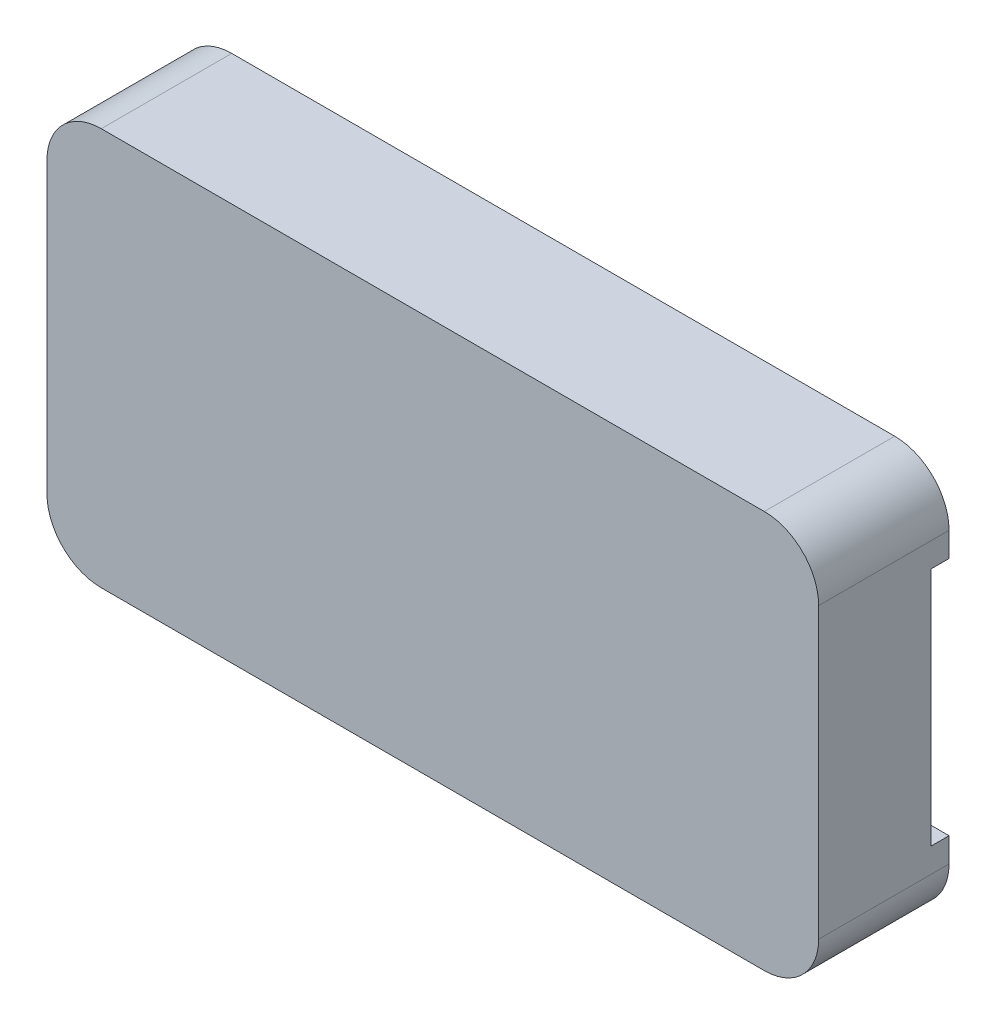
ISO-10303-21;
HEADER;
FILE_DESCRIPTION(('STEP AP214'),'2;1');
FILE_NAME('part.step','',(''),(''),'','','');
FILE_SCHEMA(('AUTOMOTIVE_DESIGN { 1 0 10303 214 1 1 1 1 }'));
ENDSEC;
DATA;
#1=APPLICATION_CONTEXT('core data for automotive mechanical design processes');
#2=APPLICATION_PROTOCOL_DEFINITION('international standard','automotive_design',2000,#1);
#3=PRODUCT_CONTEXT('',#1,'mechanical');
#4=PRODUCT('Part','Part','',(#3));
#5=PRODUCT_RELATED_PRODUCT_CATEGORY('part','',(#4));
#6=PRODUCT_DEFINITION_FORMATION('','',#4);
#7=PRODUCT_DEFINITION_CONTEXT('part definition',#1,'design');
#8=PRODUCT_DEFINITION('design','',#6,#7);
#9=PRODUCT_DEFINITION_SHAPE('','',#8);
#10=(LENGTH_UNIT() NAMED_UNIT(*) SI_UNIT(.MILLI.,.METRE.));
#11=(NAMED_UNIT(*) PLANE_ANGLE_UNIT() SI_UNIT($,.RADIAN.));
#12=(NAMED_UNIT(*) SI_UNIT($,.STERADIAN.) SOLID_ANGLE_UNIT());
#13=UNCERTAINTY_MEASURE_WITH_UNIT(LENGTH_MEASURE(1.E-05),#10,'distance_accuracy_value','');
#14=(GEOMETRIC_REPRESENTATION_CONTEXT(3) GLOBAL_UNCERTAINTY_ASSIGNED_CONTEXT((#13)) GLOBAL_UNIT_ASSIGNED_CONTEXT((#10,
#11,#12)) REPRESENTATION_CONTEXT('',''));
#15=CARTESIAN_POINT('',(0.,0.,0.));
#16=DIRECTION('',(0.,0.,1.));
#17=DIRECTION('',(1.,0.,0.));
#18=AXIS2_PLACEMENT_3D('',#15,#16,#17);
#19=CARTESIAN_POINT('',(0.,0.,5.2));
#20=DIRECTION('',(0.,0.,1.));
#21=DIRECTION('',(1.,0.,0.));
#22=AXIS2_PLACEMENT_3D('',#19,#20,#21);
#23=PLANE('',#22);
#24=DIRECTION('',(0.,1.,0.));
#25=VECTOR('',#24,1.);
#26=CARTESIAN_POINT('',(19.9,6.625,5.2));
#27=LINE('',#26,#25);
#28=CARTESIAN_POINT('',(19.9,4.925,5.2));
#29=VERTEX_POINT('',#28);
#30=CARTESIAN_POINT('',(19.9,6.625,5.2));
#31=VERTEX_POINT('',#30);
#32=EDGE_CURVE('E259',#29,#31,#27,.T.);
#33=ORIENTED_EDGE('',*,*,#32,.F.);
#34=DIRECTION('',(1.,0.,0.));
#35=VECTOR('',#34,1.);
#36=CARTESIAN_POINT('',(18.4,4.925,5.2));
#37=LINE('',#36,#35);
#38=CARTESIAN_POINT('',(18.4,4.925,5.2));
#39=VERTEX_POINT('',#38);
#40=EDGE_CURVE('E274',#39,#29,#37,.T.);
#41=ORIENTED_EDGE('',*,*,#40,.F.);
#42=DIRECTION('',(0.,1.,0.));
#43=VECTOR('',#42,1.);
#44=CARTESIAN_POINT('',(18.4,3.815,5.2));
#45=LINE('',#44,#43);
#46=CARTESIAN_POINT('',(18.4,3.815,5.2));
#47=VERTEX_POINT('',#46);
#48=EDGE_CURVE('E279',#47,#39,#45,.T.);
#49=ORIENTED_EDGE('',*,*,#48,.F.);
#50=DIRECTION('',(-1.,0.,0.));
#51=VECTOR('',#50,1.);
#52=CARTESIAN_POINT('',(19.11,3.815,5.2));
#53=LINE('',#52,#51);
#54=CARTESIAN_POINT('',(19.11,3.815,5.2));
#55=VERTEX_POINT('',#54);
#56=EDGE_CURVE('E326',#55,#47,#53,.T.);
#57=ORIENTED_EDGE('',*,*,#56,.F.);
#58=DIRECTION('',(0.,1.,0.));
#59=VECTOR('',#58,1.);
#60=CARTESIAN_POINT('',(19.11,0.555,5.2));
#61=LINE('',#60,#59);
#62=CARTESIAN_POINT('',(19.11,0.555,5.2));
#63=VERTEX_POINT('',#62);
#64=EDGE_CURVE('E323',#63,#55,#61,.T.);
#65=ORIENTED_EDGE('',*,*,#64,.F.);
#66=DIRECTION('',(1.,0.,0.));
#67=VECTOR('',#66,1.);
#68=CARTESIAN_POINT('',(18.4,0.555,5.2));
#69=LINE('',#68,#67);
#70=CARTESIAN_POINT('',(18.4,0.555,5.2));
#71=VERTEX_POINT('',#70);
#72=EDGE_CURVE('E320',#71,#63,#69,.T.);
#73=ORIENTED_EDGE('',*,*,#72,.F.);
#74=DIRECTION('',(0.,1.,0.));
#75=VECTOR('',#74,1.);
#76=CARTESIAN_POINT('',(18.4,-0.555,5.2));
#77=LINE('',#76,#75);
#78=CARTESIAN_POINT('',(18.4,-0.555,5.2));
#79=VERTEX_POINT('',#78);
#80=EDGE_CURVE('E317',#79,#71,#77,.T.);
#81=ORIENTED_EDGE('',*,*,#80,.F.);
#82=DIRECTION('',(-1.,0.,0.));
#83=VECTOR('',#82,1.);
#84=CARTESIAN_POINT('',(19.11,-0.555,5.2));
#85=LINE('',#84,#83);
#86=CARTESIAN_POINT('',(19.11,-0.555,5.2));
#87=VERTEX_POINT('',#86);
#88=EDGE_CURVE('E314',#87,#79,#85,.T.);
#89=ORIENTED_EDGE('',*,*,#88,.F.);
#90=DIRECTION('',(0.,1.,0.));
#91=VECTOR('',#90,1.);
#92=CARTESIAN_POINT('',(19.11,-3.815,5.2));
#93=LINE('',#92,#91);
#94=CARTESIAN_POINT('',(19.11,-3.815,5.2));
#95=VERTEX_POINT('',#94);
#96=EDGE_CURVE('E311',#95,#87,#93,.T.);
#97=ORIENTED_EDGE('',*,*,#96,.F.);
#98=DIRECTION('',(1.,0.,0.));
#99=VECTOR('',#98,1.);
#100=CARTESIAN_POINT('',(18.4,-3.815,5.2));
#101=LINE('',#100,#99);
#102=CARTESIAN_POINT('',(18.4,-3.815,5.2));
#103=VERTEX_POINT('',#102);
#104=EDGE_CURVE('E308',#103,#95,#101,.T.);
#105=ORIENTED_EDGE('',*,*,#104,.F.);
#106=DIRECTION('',(0.,1.,0.));
#107=VECTOR('',#106,1.);
#108=CARTESIAN_POINT('',(18.4,-4.925,5.2));
#109=LINE('',#108,#107);
#110=CARTESIAN_POINT('',(18.4,-4.925,5.2));
#111=VERTEX_POINT('',#110);
#112=EDGE_CURVE('E305',#111,#103,#109,.T.);
#113=ORIENTED_EDGE('',*,*,#112,.F.);
#114=DIRECTION('',(-1.,0.,0.));
#115=VECTOR('',#114,1.);
#116=CARTESIAN_POINT('',(20.15,-4.925,5.2));
#117=LINE('',#116,#115);
#118=CARTESIAN_POINT('',(19.9,-4.925,5.2));
#119=VERTEX_POINT('',#118);
#120=EDGE_CURVE('E303',#119,#111,#117,.T.);
#121=ORIENTED_EDGE('',*,*,#120,.F.);
#122=DIRECTION('',(0.,1.,0.));
#123=VECTOR('',#122,1.);
#124=CARTESIAN_POINT('',(19.9,-4.925,5.2));
#125=LINE('',#124,#123);
#126=CARTESIAN_POINT('',(19.9,-6.625,5.2));
#127=VERTEX_POINT('',#126);
#128=EDGE_CURVE('E262',#127,#119,#125,.T.);
#129=ORIENTED_EDGE('',*,*,#128,.F.);
#130=DIRECTION('',(-1.,0.,0.));
#131=VECTOR('',#130,1.);
#132=CARTESIAN_POINT('',(17.23,-6.625,5.2));
#133=LINE('',#132,#131);
#134=CARTESIAN_POINT('',(17.23,-6.625,5.2));
#135=VERTEX_POINT('',#134);
#136=EDGE_CURVE('E361',#127,#135,#133,.T.);
#137=ORIENTED_EDGE('',*,*,#136,.T.);
#138=DIRECTION('',(0.,1.,0.));
#139=VECTOR('',#138,1.);
#140=CARTESIAN_POINT('',(17.23,6.625,5.2));
#141=LINE('',#140,#139);
#142=CARTESIAN_POINT('',(17.23,6.625,5.2));
#143=VERTEX_POINT('',#142);
#144=EDGE_CURVE('E363',#135,#143,#141,.T.);
#145=ORIENTED_EDGE('',*,*,#144,.T.);
#146=DIRECTION('',(1.,0.,0.));
#147=VECTOR('',#146,1.);
#148=CARTESIAN_POINT('',(21.3,6.625,5.2));
#149=LINE('',#148,#147);
#150=EDGE_CURVE('E367',#143,#31,#149,.T.);
#151=ORIENTED_EDGE('',*,*,#150,.T.);
#152=EDGE_LOOP('',(#33,#41,#49,#57,#65,#73,#81,#89,#97,#105,#113,#121,#129,#137,#145,#151));
#153=FACE_BOUND('',#152,.T.);
#154=ADVANCED_FACE('F41',(#153),#23,.F.);
#155=CARTESIAN_POINT('',(21.3,6.625,5.2));
#156=DIRECTION('',(0.,1.,0.));
#157=DIRECTION('',(0.,0.,1.));
#158=AXIS2_PLACEMENT_3D('',#155,#156,#157);
#159=PLANE('',#158);
#160=DIRECTION('',(0.,0.,1.));
#161=VECTOR('',#160,1.);
#162=CARTESIAN_POINT('',(19.9,6.625,1.));
#163=LINE('',#162,#161);
#164=CARTESIAN_POINT('',(19.9,6.625,1.));
#165=VERTEX_POINT('',#164);
#166=EDGE_CURVE('E61',#165,#31,#163,.T.);
#167=ORIENTED_EDGE('',*,*,#166,.T.);
#168=ORIENTED_EDGE('',*,*,#150,.F.);
#169=DIRECTION('',(0.,0.,-1.));
#170=VECTOR('',#169,1.);
#171=CARTESIAN_POINT('',(17.23,6.625,5.2));
#172=LINE('',#171,#170);
#173=CARTESIAN_POINT('',(17.23,6.625,0.));
#174=VERTEX_POINT('',#173);
#175=EDGE_CURVE('E380',#143,#174,#172,.T.);
#176=ORIENTED_EDGE('',*,*,#175,.T.);
#177=DIRECTION('',(1.,0.,0.));
#178=VECTOR('',#177,1.);
#179=CARTESIAN_POINT('',(21.3,6.625,0.));
#180=LINE('',#179,#178);
#181=CARTESIAN_POINT('',(21.3,6.625,0.));
#182=VERTEX_POINT('',#181);
#183=EDGE_CURVE('E364',#174,#182,#180,.T.);
#184=ORIENTED_EDGE('',*,*,#183,.T.);
#185=DIRECTION('',(0.,0.,-1.));
#186=VECTOR('',#185,1.);
#187=CARTESIAN_POINT('',(21.3,6.625,5.2));
#188=LINE('',#187,#186);
#189=CARTESIAN_POINT('',(21.3,6.625,1.));
#190=VERTEX_POINT('',#189);
#191=EDGE_CURVE('E377',#190,#182,#188,.T.);
#192=ORIENTED_EDGE('',*,*,#191,.F.);
#193=DIRECTION('',(1.,0.,0.));
#194=VECTOR('',#193,1.);
#195=CARTESIAN_POINT('',(21.3,6.625,1.));
#196=LINE('',#195,#194);
#197=EDGE_CURVE('E56',#165,#190,#196,.T.);
#198=ORIENTED_EDGE('',*,*,#197,.F.);
#199=EDGE_LOOP('',(#167,#168,#176,#184,#192,#198));
#200=FACE_BOUND('',#199,.T.);
#201=ADVANCED_FACE('F540',(#200),#159,.F.);
#202=CARTESIAN_POINT('',(17.23,-6.625,5.2));
#203=DIRECTION('',(0.,-1.,0.));
#204=DIRECTION('',(0.,0.,-1.));
#205=AXIS2_PLACEMENT_3D('',#202,#203,#204);
#206=PLANE('',#205);
#207=DIRECTION('',(0.,0.,1.));
#208=VECTOR('',#207,1.);
#209=CARTESIAN_POINT('',(19.9,-6.625,1.));
#210=LINE('',#209,#208);
#211=CARTESIAN_POINT('',(19.9,-6.625,1.));
#212=VERTEX_POINT('',#211);
#213=EDGE_CURVE('E270',#212,#127,#210,.T.);
#214=ORIENTED_EDGE('',*,*,#213,.F.);
#215=DIRECTION('',(-1.,0.,0.));
#216=VECTOR('',#215,1.);
#217=CARTESIAN_POINT('',(19.9,-6.625,1.));
#218=LINE('',#217,#216);
#219=CARTESIAN_POINT('',(21.3,-6.625,1.));
#220=VERTEX_POINT('',#219);
#221=EDGE_CURVE('E253',#220,#212,#218,.T.);
#222=ORIENTED_EDGE('',*,*,#221,.F.);
#223=DIRECTION('',(0.,0.,-1.));
#224=VECTOR('',#223,1.);
#225=CARTESIAN_POINT('',(21.3,-6.625,5.2));
#226=LINE('',#225,#224);
#227=CARTESIAN_POINT('',(21.3,-6.625,0.));
#228=VERTEX_POINT('',#227);
#229=EDGE_CURVE('E369',#220,#228,#226,.T.);
#230=ORIENTED_EDGE('',*,*,#229,.T.);
#231=DIRECTION('',(-1.,0.,0.));
#232=VECTOR('',#231,1.);
#233=CARTESIAN_POINT('',(17.23,-6.625,0.));
#234=LINE('',#233,#232);
#235=CARTESIAN_POINT('',(17.23,-6.625,0.));
#236=VERTEX_POINT('',#235);
#237=EDGE_CURVE('E360',#228,#236,#234,.T.);
#238=ORIENTED_EDGE('',*,*,#237,.T.);
#239=DIRECTION('',(0.,0.,-1.));
#240=VECTOR('',#239,1.);
#241=CARTESIAN_POINT('',(17.23,-6.625,5.2));
#242=LINE('',#241,#240);
#243=EDGE_CURVE('E382',#135,#236,#242,.T.);
#244=ORIENTED_EDGE('',*,*,#243,.F.);
#245=ORIENTED_EDGE('',*,*,#136,.F.);
#246=EDGE_LOOP('',(#214,#222,#230,#238,#244,#245));
#247=FACE_BOUND('',#246,.T.);
#248=ADVANCED_FACE('F484',(#247),#206,.F.);
#249=CARTESIAN_POINT('',(18.4,4.925,0.));
#250=DIRECTION('',(0.,-1.,0.));
#251=DIRECTION('',(0.,0.,-1.));
#252=AXIS2_PLACEMENT_3D('',#249,#250,#251);
#253=PLANE('',#252);
#254=DIRECTION('',(0.,0.,1.));
#255=VECTOR('',#254,1.);
#256=CARTESIAN_POINT('',(19.9,4.925,1.));
#257=LINE('',#256,#255);
#258=CARTESIAN_POINT('',(19.9,4.925,1.));
#259=VERTEX_POINT('',#258);
#260=EDGE_CURVE('E258',#259,#29,#257,.T.);
#261=ORIENTED_EDGE('',*,*,#260,.F.);
#262=DIRECTION('',(-1.,0.,0.));
#263=VECTOR('',#262,1.);
#264=CARTESIAN_POINT('',(19.9,4.925,1.));
#265=LINE('',#264,#263);
#266=CARTESIAN_POINT('',(20.15,4.925,1.));
#267=VERTEX_POINT('',#266);
#268=EDGE_CURVE('E245',#267,#259,#265,.T.);
#269=ORIENTED_EDGE('',*,*,#268,.F.);
#270=DIRECTION('',(0.,0.,1.));
#271=VECTOR('',#270,1.);
#272=CARTESIAN_POINT('',(20.15,4.925,0.));
#273=LINE('',#272,#271);
#274=CARTESIAN_POINT('',(20.15,4.925,0.));
#275=VERTEX_POINT('',#274);
#276=EDGE_CURVE('E235',#275,#267,#273,.T.);
#277=ORIENTED_EDGE('',*,*,#276,.F.);
#278=DIRECTION('',(1.,0.,0.));
#279=VECTOR('',#278,1.);
#280=CARTESIAN_POINT('',(18.4,4.925,0.));
#281=LINE('',#280,#279);
#282=CARTESIAN_POINT('',(18.4,4.925,0.));
#283=VERTEX_POINT('',#282);
#284=EDGE_CURVE('E275',#283,#275,#281,.T.);
#285=ORIENTED_EDGE('',*,*,#284,.F.);
#286=DIRECTION('',(0.,0.,1.));
#287=VECTOR('',#286,1.);
#288=CARTESIAN_POINT('',(18.4,4.925,0.));
#289=LINE('',#288,#287);
#290=EDGE_CURVE('E300',#283,#39,#289,.T.);
#291=ORIENTED_EDGE('',*,*,#290,.T.);
#292=ORIENTED_EDGE('',*,*,#40,.T.);
#293=EDGE_LOOP('',(#261,#269,#277,#285,#291,#292));
#294=FACE_BOUND('',#293,.T.);
#295=ADVANCED_FACE('F497',(#294),#253,.F.);
#296=CARTESIAN_POINT('',(20.15,4.925,0.));
#297=DIRECTION('',(-1.,0.,0.));
#298=DIRECTION('',(0.,0.,1.));
#299=AXIS2_PLACEMENT_3D('',#296,#297,#298);
#300=PLANE('',#299);
#301=DIRECTION('',(0.,1.,0.));
#302=VECTOR('',#301,1.);
#303=CARTESIAN_POINT('',(20.15,4.925,1.));
#304=LINE('',#303,#302);
#305=CARTESIAN_POINT('',(20.15,-4.925,1.));
#306=VERTEX_POINT('',#305);
#307=EDGE_CURVE('E240',#306,#267,#304,.T.);
#308=ORIENTED_EDGE('',*,*,#307,.F.);
#309=DIRECTION('',(0.,0.,1.));
#310=VECTOR('',#309,1.);
#311=CARTESIAN_POINT('',(20.15,-4.925,0.));
#312=LINE('',#311,#310);
#313=CARTESIAN_POINT('',(20.15,-4.925,0.));
#314=VERTEX_POINT('',#313);
#315=EDGE_CURVE('E226',#314,#306,#312,.T.);
#316=ORIENTED_EDGE('',*,*,#315,.F.);
#317=DIRECTION('',(0.,-1.,0.));
#318=VECTOR('',#317,1.);
#319=CARTESIAN_POINT('',(20.15,4.925,0.));
#320=LINE('',#319,#318);
#321=EDGE_CURVE('E278',#275,#314,#320,.T.);
#322=ORIENTED_EDGE('',*,*,#321,.F.);
#323=ORIENTED_EDGE('',*,*,#276,.T.);
#324=EDGE_LOOP('',(#308,#316,#322,#323));
#325=FACE_BOUND('',#324,.T.);
#326=ADVANCED_FACE('F241',(#325),#300,.F.);
#327=CARTESIAN_POINT('',(20.15,-4.925,0.));
#328=DIRECTION('',(0.,1.,0.));
#329=DIRECTION('',(0.,0.,1.));
#330=AXIS2_PLACEMENT_3D('',#327,#328,#329);
#331=PLANE('',#330);
#332=DIRECTION('',(0.,0.,1.));
#333=VECTOR('',#332,1.);
#334=CARTESIAN_POINT('',(19.9,-4.925,1.));
#335=LINE('',#334,#333);
#336=CARTESIAN_POINT('',(19.9,-4.925,1.));
#337=VERTEX_POINT('',#336);
#338=EDGE_CURVE('E268',#337,#119,#335,.T.);
#339=ORIENTED_EDGE('',*,*,#338,.T.);
#340=ORIENTED_EDGE('',*,*,#120,.T.);
#341=DIRECTION('',(0.,0.,1.));
#342=VECTOR('',#341,1.);
#343=CARTESIAN_POINT('',(18.4,-4.925,0.));
#344=LINE('',#343,#342);
#345=CARTESIAN_POINT('',(18.4,-4.925,0.));
#346=VERTEX_POINT('',#345);
#347=EDGE_CURVE('E236',#346,#111,#344,.T.);
#348=ORIENTED_EDGE('',*,*,#347,.F.);
#349=DIRECTION('',(-1.,0.,0.));
#350=VECTOR('',#349,1.);
#351=CARTESIAN_POINT('',(20.15,-4.925,0.));
#352=LINE('',#351,#350);
#353=EDGE_CURVE('E233',#314,#346,#352,.T.);
#354=ORIENTED_EDGE('',*,*,#353,.F.);
#355=ORIENTED_EDGE('',*,*,#315,.T.);
#356=DIRECTION('',(1.,0.,0.));
#357=VECTOR('',#356,1.);
#358=CARTESIAN_POINT('',(20.15,-4.925,1.));
#359=LINE('',#358,#357);
#360=EDGE_CURVE('E230',#337,#306,#359,.T.);
#361=ORIENTED_EDGE('',*,*,#360,.F.);
#362=EDGE_LOOP('',(#339,#340,#348,#354,#355,#361));
#363=FACE_BOUND('',#362,.T.);
#364=ADVANCED_FACE('F228',(#363),#331,.F.);
#365=CARTESIAN_POINT('',(-21.3,-10.975,7.2));
#366=DIRECTION('',(1.,0.,0.));
#367=DIRECTION('',(0.,0.,-1.));
#368=AXIS2_PLACEMENT_3D('',#365,#366,#367);
#369=PLANE('',#368);
#370=DIRECTION('',(0.,-1.,0.));
#371=VECTOR('',#370,1.);
#372=CARTESIAN_POINT('',(-21.3,-10.975,0.));
#373=LINE('',#372,#371);
#374=CARTESIAN_POINT('',(-21.3,7.975,0.));
#375=VERTEX_POINT('',#374);
#376=CARTESIAN_POINT('',(-21.3,-7.975,0.));
#377=VERTEX_POINT('',#376);
#378=EDGE_CURVE('E379',#375,#377,#373,.T.);
#379=ORIENTED_EDGE('',*,*,#378,.T.);
#380=DIRECTION('',(0.,0.,-1.));
#381=VECTOR('',#380,1.);
#382=CARTESIAN_POINT('',(-21.3,-7.975,7.2));
#383=LINE('',#382,#381);
#384=CARTESIAN_POINT('',(-21.3,-7.975,7.2));
#385=VERTEX_POINT('',#384);
#386=EDGE_CURVE('E426',#377,#385,#383,.F.);
#387=ORIENTED_EDGE('',*,*,#386,.T.);
#388=DIRECTION('',(0.,-1.,0.));
#389=VECTOR('',#388,1.);
#390=CARTESIAN_POINT('',(-21.3,-10.975,7.2));
#391=LINE('',#390,#389);
#392=CARTESIAN_POINT('',(-21.3,7.975,7.2));
#393=VERTEX_POINT('',#392);
#394=EDGE_CURVE('E385',#393,#385,#391,.T.);
#395=ORIENTED_EDGE('',*,*,#394,.F.);
#396=DIRECTION('',(0.,0.,-1.));
#397=VECTOR('',#396,1.);
#398=CARTESIAN_POINT('',(-21.3,7.975,7.2));
#399=LINE('',#398,#397);
#400=EDGE_CURVE('E423',#393,#375,#399,.T.);
#401=ORIENTED_EDGE('',*,*,#400,.T.);
#402=EDGE_LOOP('',(#379,#387,#395,#401));
#403=FACE_BOUND('',#402,.T.);
#404=ADVANCED_FACE('F455',(#403),#369,.F.);
#405=CARTESIAN_POINT('',(21.3,-10.975,7.2));
#406=DIRECTION('',(0.,1.,0.));
#407=DIRECTION('',(-1.,0.,0.));
#408=AXIS2_PLACEMENT_3D('',#405,#406,#407);
#409=PLANE('',#408);
#410=DIRECTION('',(1.,0.,0.));
#411=VECTOR('',#410,1.);
#412=CARTESIAN_POINT('',(21.3,-10.975,7.2));
#413=LINE('',#412,#411);
#414=CARTESIAN_POINT('',(-18.3,-10.975,7.2));
#415=VERTEX_POINT('',#414);
#416=CARTESIAN_POINT('',(18.3,-10.975,7.2));
#417=VERTEX_POINT('',#416);
#418=EDGE_CURVE('E388',#415,#417,#413,.T.);
#419=ORIENTED_EDGE('',*,*,#418,.F.);
#420=DIRECTION('',(0.,0.,-1.));
#421=VECTOR('',#420,1.);
#422=CARTESIAN_POINT('',(-18.3,-10.975,7.2));
#423=LINE('',#422,#421);
#424=CARTESIAN_POINT('',(-18.3,-10.975,0.));
#425=VERTEX_POINT('',#424);
#426=EDGE_CURVE('E411',#415,#425,#423,.T.);
#427=ORIENTED_EDGE('',*,*,#426,.T.);
#428=DIRECTION('',(1.,0.,0.));
#429=VECTOR('',#428,1.);
#430=CARTESIAN_POINT('',(21.3,-10.975,0.));
#431=LINE('',#430,#429);
#432=CARTESIAN_POINT('',(18.3,-10.975,0.));
#433=VERTEX_POINT('',#432);
#434=EDGE_CURVE('E401',#425,#433,#431,.T.);
#435=ORIENTED_EDGE('',*,*,#434,.T.);
#436=DIRECTION('',(0.,0.,-1.));
#437=VECTOR('',#436,1.);
#438=CARTESIAN_POINT('',(18.3,-10.975,7.2));
#439=LINE('',#438,#437);
#440=EDGE_CURVE('E398',#433,#417,#439,.F.);
#441=ORIENTED_EDGE('',*,*,#440,.T.);
#442=EDGE_LOOP('',(#419,#427,#435,#441));
#443=FACE_BOUND('',#442,.T.);
#444=ADVANCED_FACE('F467',(#443),#409,.F.);
#445=CARTESIAN_POINT('',(21.3,-10.975,7.2));
#446=DIRECTION('',(-1.,0.,0.));
#447=DIRECTION('',(0.,0.,1.));
#448=AXIS2_PLACEMENT_3D('',#445,#446,#447);
#449=PLANE('',#448);
#450=DIRECTION('',(0.,-1.,0.));
#451=VECTOR('',#450,1.);
#452=CARTESIAN_POINT('',(21.3,6.625,1.));
#453=LINE('',#452,#451);
#454=EDGE_CURVE('E488',#190,#220,#453,.T.);
#455=ORIENTED_EDGE('',*,*,#454,.F.);
#456=ORIENTED_EDGE('',*,*,#191,.T.);
#457=DIRECTION('',(0.,1.,0.));
#458=VECTOR('',#457,1.);
#459=CARTESIAN_POINT('',(21.3,-10.975,0.));
#460=LINE('',#459,#458);
#461=CARTESIAN_POINT('',(21.3,7.975,0.));
#462=VERTEX_POINT('',#461);
#463=EDGE_CURVE('E404',#182,#462,#460,.T.);
#464=ORIENTED_EDGE('',*,*,#463,.T.);
#465=DIRECTION('',(0.,0.,-1.));
#466=VECTOR('',#465,1.);
#467=CARTESIAN_POINT('',(21.3,7.975,7.2));
#468=LINE('',#467,#466);
#469=CARTESIAN_POINT('',(21.3,7.975,7.2));
#470=VERTEX_POINT('',#469);
#471=EDGE_CURVE('E436',#462,#470,#468,.F.);
#472=ORIENTED_EDGE('',*,*,#471,.T.);
#473=DIRECTION('',(0.,1.,0.));
#474=VECTOR('',#473,1.);
#475=CARTESIAN_POINT('',(21.3,-10.975,7.2));
#476=LINE('',#475,#474);
#477=CARTESIAN_POINT('',(21.3,-7.975,7.2));
#478=VERTEX_POINT('',#477);
#479=EDGE_CURVE('E392',#478,#470,#476,.T.);
#480=ORIENTED_EDGE('',*,*,#479,.F.);
#481=DIRECTION('',(0.,0.,-1.));
#482=VECTOR('',#481,1.);
#483=CARTESIAN_POINT('',(21.3,-7.975,7.2));
#484=LINE('',#483,#482);
#485=CARTESIAN_POINT('',(21.3,-7.975,0.));
#486=VERTEX_POINT('',#485);
#487=EDGE_CURVE('E438',#478,#486,#484,.T.);
#488=ORIENTED_EDGE('',*,*,#487,.T.);
#489=EDGE_CURVE('E405',#486,#228,#460,.T.);
#490=ORIENTED_EDGE('',*,*,#489,.T.);
#491=ORIENTED_EDGE('',*,*,#229,.F.);
#492=EDGE_LOOP('',(#455,#456,#464,#472,#480,#488,#490,#491));
#493=FACE_BOUND('',#492,.T.);
#494=ADVANCED_FACE('F477',(#493),#449,.F.);
#495=CARTESIAN_POINT('',(21.3,10.975,7.2));
#496=DIRECTION('',(0.,-1.,0.));
#497=DIRECTION('',(1.,0.,0.));
#498=AXIS2_PLACEMENT_3D('',#495,#496,#497);
#499=PLANE('',#498);
#500=DIRECTION('',(-1.,0.,0.));
#501=VECTOR('',#500,1.);
#502=CARTESIAN_POINT('',(21.3,10.975,7.2));
#503=LINE('',#502,#501);
#504=CARTESIAN_POINT('',(18.3,10.975,7.2));
#505=VERTEX_POINT('',#504);
#506=CARTESIAN_POINT('',(-18.3,10.975,7.2));
#507=VERTEX_POINT('',#506);
#508=EDGE_CURVE('E395',#505,#507,#503,.T.);
#509=ORIENTED_EDGE('',*,*,#508,.F.);
#510=DIRECTION('',(0.,0.,-1.));
#511=VECTOR('',#510,1.);
#512=CARTESIAN_POINT('',(18.3,10.975,7.2));
#513=LINE('',#512,#511);
#514=CARTESIAN_POINT('',(18.3,10.975,0.));
#515=VERTEX_POINT('',#514);
#516=EDGE_CURVE('E11',#505,#515,#513,.T.);
#517=ORIENTED_EDGE('',*,*,#516,.T.);
#518=DIRECTION('',(-1.,0.,0.));
#519=VECTOR('',#518,1.);
#520=CARTESIAN_POINT('',(21.3,10.975,0.));
#521=LINE('',#520,#519);
#522=CARTESIAN_POINT('',(-18.3,10.975,0.));
#523=VERTEX_POINT('',#522);
#524=EDGE_CURVE('E389',#515,#523,#521,.T.);
#525=ORIENTED_EDGE('',*,*,#524,.T.);
#526=DIRECTION('',(0.,0.,-1.));
#527=VECTOR('',#526,1.);
#528=CARTESIAN_POINT('',(-18.3,10.975,7.2));
#529=LINE('',#528,#527);
#530=EDGE_CURVE('E49',#523,#507,#529,.F.);
#531=ORIENTED_EDGE('',*,*,#530,.T.);
#532=EDGE_LOOP('',(#509,#517,#525,#531));
#533=FACE_BOUND('',#532,.T.);
#534=ADVANCED_FACE('F443',(#533),#499,.F.);
#535=CARTESIAN_POINT('',(0.,0.,7.2));
#536=DIRECTION('',(0.,0.,1.));
#537=DIRECTION('',(1.,0.,0.));
#538=AXIS2_PLACEMENT_3D('',#535,#536,#537);
#539=PLANE('',#538);
#540=ORIENTED_EDGE('',*,*,#394,.T.);
#541=CARTESIAN_POINT('',(-18.3,-7.975,7.2));
#542=DIRECTION('',(0.,0.,1.));
#543=DIRECTION('',(1.,0.,0.));
#544=AXIS2_PLACEMENT_3D('',#541,#542,#543);
#545=CIRCLE('',#544,3.);
#546=EDGE_CURVE('E434',#385,#415,#545,.T.);
#547=ORIENTED_EDGE('',*,*,#546,.T.);
#548=ORIENTED_EDGE('',*,*,#418,.T.);
#549=CARTESIAN_POINT('',(18.3,-7.975,7.2));
#550=DIRECTION('',(0.,0.,1.));
#551=DIRECTION('',(1.,0.,0.));
#552=AXIS2_PLACEMENT_3D('',#549,#550,#551);
#553=CIRCLE('',#552,3.);
#554=EDGE_CURVE('E432',#417,#478,#553,.T.);
#555=ORIENTED_EDGE('',*,*,#554,.T.);
#556=ORIENTED_EDGE('',*,*,#479,.T.);
#557=CARTESIAN_POINT('',(18.3,7.975,7.2));
#558=DIRECTION('',(0.,0.,1.));
#559=DIRECTION('',(1.,0.,0.));
#560=AXIS2_PLACEMENT_3D('',#557,#558,#559);
#561=CIRCLE('',#560,3.);
#562=EDGE_CURVE('E430',#470,#505,#561,.T.);
#563=ORIENTED_EDGE('',*,*,#562,.T.);
#564=ORIENTED_EDGE('',*,*,#508,.T.);
#565=CARTESIAN_POINT('',(-18.3,7.975,7.2));
#566=DIRECTION('',(0.,0.,1.));
#567=DIRECTION('',(1.,0.,0.));
#568=AXIS2_PLACEMENT_3D('',#565,#566,#567);
#569=CIRCLE('',#568,3.);
#570=EDGE_CURVE('E428',#507,#393,#569,.T.);
#571=ORIENTED_EDGE('',*,*,#570,.T.);
#572=EDGE_LOOP('',(#540,#547,#548,#555,#556,#563,#564,#571));
#573=FACE_BOUND('',#572,.T.);
#574=ADVANCED_FACE('F449',(#573),#539,.T.);
#575=CARTESIAN_POINT('',(0.,0.,0.));
#576=DIRECTION('',(0.,0.,1.));
#577=DIRECTION('',(1.,0.,0.));
#578=AXIS2_PLACEMENT_3D('',#575,#576,#577);
#579=PLANE('',#578);
#580=ORIENTED_EDGE('',*,*,#463,.F.);
#581=ORIENTED_EDGE('',*,*,#183,.F.);
#582=DIRECTION('',(0.,1.,0.));
#583=VECTOR('',#582,1.);
#584=CARTESIAN_POINT('',(17.23,6.625,0.));
#585=LINE('',#584,#583);
#586=EDGE_CURVE('E372',#236,#174,#585,.T.);
#587=ORIENTED_EDGE('',*,*,#586,.F.);
#588=ORIENTED_EDGE('',*,*,#237,.F.);
#589=ORIENTED_EDGE('',*,*,#489,.F.);
#590=CARTESIAN_POINT('',(18.3,-7.975,0.));
#591=DIRECTION('',(0.,0.,1.));
#592=DIRECTION('',(1.,0.,0.));
#593=AXIS2_PLACEMENT_3D('',#590,#591,#592);
#594=CIRCLE('',#593,3.);
#595=EDGE_CURVE('E419',#486,#433,#594,.F.);
#596=ORIENTED_EDGE('',*,*,#595,.T.);
#597=ORIENTED_EDGE('',*,*,#434,.F.);
#598=CARTESIAN_POINT('',(-18.3,-7.975,0.));
#599=DIRECTION('',(0.,0.,1.));
#600=DIRECTION('',(1.,0.,0.));
#601=AXIS2_PLACEMENT_3D('',#598,#599,#600);
#602=CIRCLE('',#601,3.);
#603=EDGE_CURVE('E421',#425,#377,#602,.F.);
#604=ORIENTED_EDGE('',*,*,#603,.T.);
#605=ORIENTED_EDGE('',*,*,#378,.F.);
#606=CARTESIAN_POINT('',(-18.3,7.975,0.));
#607=DIRECTION('',(0.,0.,1.));
#608=DIRECTION('',(1.,0.,0.));
#609=AXIS2_PLACEMENT_3D('',#606,#607,#608);
#610=CIRCLE('',#609,3.);
#611=EDGE_CURVE('E414',#375,#523,#610,.F.);
#612=ORIENTED_EDGE('',*,*,#611,.T.);
#613=ORIENTED_EDGE('',*,*,#524,.F.);
#614=CARTESIAN_POINT('',(18.3,7.975,0.));
#615=DIRECTION('',(0.,0.,1.));
#616=DIRECTION('',(1.,0.,0.));
#617=AXIS2_PLACEMENT_3D('',#614,#615,#616);
#618=CIRCLE('',#617,3.);
#619=EDGE_CURVE('E416',#515,#462,#618,.F.);
#620=ORIENTED_EDGE('',*,*,#619,.T.);
#621=EDGE_LOOP('',(#580,#581,#587,#588,#589,#596,#597,#604,#605,#612,#613,#620));
#622=FACE_BOUND('',#621,.T.);
#623=ADVANCED_FACE('F459',(#622),#579,.F.);
#624=CARTESIAN_POINT('',(-18.3,-7.975,7.2));
#625=DIRECTION('',(0.,0.,-1.));
#626=DIRECTION('',(-1.,0.,0.));
#627=AXIS2_PLACEMENT_3D('',#624,#625,#626);
#628=CYLINDRICAL_SURFACE('',#627,3.);
#629=ORIENTED_EDGE('',*,*,#546,.F.);
#630=ORIENTED_EDGE('',*,*,#386,.F.);
#631=ORIENTED_EDGE('',*,*,#603,.F.);
#632=ORIENTED_EDGE('',*,*,#426,.F.);
#633=EDGE_LOOP('',(#629,#630,#631,#632));
#634=FACE_BOUND('',#633,.T.);
#635=ADVANCED_FACE('F464',(#634),#628,.T.);
#636=CARTESIAN_POINT('',(18.3,-7.975,7.2));
#637=DIRECTION('',(0.,0.,-1.));
#638=DIRECTION('',(-1.,0.,0.));
#639=AXIS2_PLACEMENT_3D('',#636,#637,#638);
#640=CYLINDRICAL_SURFACE('',#639,3.);
#641=ORIENTED_EDGE('',*,*,#554,.F.);
#642=ORIENTED_EDGE('',*,*,#440,.F.);
#643=ORIENTED_EDGE('',*,*,#595,.F.);
#644=ORIENTED_EDGE('',*,*,#487,.F.);
#645=EDGE_LOOP('',(#641,#642,#643,#644));
#646=FACE_BOUND('',#645,.T.);
#647=ADVANCED_FACE('F473',(#646),#640,.T.);
#648=CARTESIAN_POINT('',(18.3,7.975,7.2));
#649=DIRECTION('',(0.,0.,-1.));
#650=DIRECTION('',(-1.,0.,0.));
#651=AXIS2_PLACEMENT_3D('',#648,#649,#650);
#652=CYLINDRICAL_SURFACE('',#651,3.);
#653=ORIENTED_EDGE('',*,*,#562,.F.);
#654=ORIENTED_EDGE('',*,*,#471,.F.);
#655=ORIENTED_EDGE('',*,*,#619,.F.);
#656=ORIENTED_EDGE('',*,*,#516,.F.);
#657=EDGE_LOOP('',(#653,#654,#655,#656));
#658=FACE_BOUND('',#657,.T.);
#659=ADVANCED_FACE('F544',(#658),#652,.T.);
#660=CARTESIAN_POINT('',(-18.3,7.975,7.2));
#661=DIRECTION('',(0.,0.,-1.));
#662=DIRECTION('',(-1.,0.,0.));
#663=AXIS2_PLACEMENT_3D('',#660,#661,#662);
#664=CYLINDRICAL_SURFACE('',#663,3.);
#665=ORIENTED_EDGE('',*,*,#570,.F.);
#666=ORIENTED_EDGE('',*,*,#530,.F.);
#667=ORIENTED_EDGE('',*,*,#611,.F.);
#668=ORIENTED_EDGE('',*,*,#400,.F.);
#669=EDGE_LOOP('',(#665,#666,#667,#668));
#670=FACE_BOUND('',#669,.T.);
#671=ADVANCED_FACE('F43',(#670),#664,.T.);
#672=CARTESIAN_POINT('',(17.23,6.625,5.2));
#673=DIRECTION('',(-1.,0.,0.));
#674=DIRECTION('',(0.,-1.,0.));
#675=AXIS2_PLACEMENT_3D('',#672,#673,#674);
#676=PLANE('',#675);
#677=ORIENTED_EDGE('',*,*,#586,.T.);
#678=ORIENTED_EDGE('',*,*,#175,.F.);
#679=ORIENTED_EDGE('',*,*,#144,.F.);
#680=ORIENTED_EDGE('',*,*,#243,.T.);
#681=EDGE_LOOP('',(#677,#678,#679,#680));
#682=FACE_BOUND('',#681,.T.);
#683=ADVANCED_FACE('F541',(#682),#676,.F.);
#684=CARTESIAN_POINT('',(18.4,-4.925,0.));
#685=DIRECTION('',(1.,0.,0.));
#686=DIRECTION('',(0.,0.,-1.));
#687=AXIS2_PLACEMENT_3D('',#684,#685,#686);
#688=PLANE('',#687);
#689=ORIENTED_EDGE('',*,*,#112,.T.);
#690=DIRECTION('',(0.,0.,1.));
#691=VECTOR('',#690,1.);
#692=CARTESIAN_POINT('',(18.4,-3.815,0.));
#693=LINE('',#692,#691);
#694=CARTESIAN_POINT('',(18.4,-3.815,0.));
#695=VERTEX_POINT('',#694);
#696=EDGE_CURVE('E354',#695,#103,#693,.T.);
#697=ORIENTED_EDGE('',*,*,#696,.F.);
#698=DIRECTION('',(0.,1.,0.));
#699=VECTOR('',#698,1.);
#700=CARTESIAN_POINT('',(18.4,-4.925,0.));
#701=LINE('',#700,#699);
#702=EDGE_CURVE('E282',#346,#695,#701,.T.);
#703=ORIENTED_EDGE('',*,*,#702,.F.);
#704=ORIENTED_EDGE('',*,*,#347,.T.);
#705=EDGE_LOOP('',(#689,#697,#703,#704));
#706=FACE_BOUND('',#705,.T.);
#707=ADVANCED_FACE('F535',(#706),#688,.F.);
#708=CARTESIAN_POINT('',(18.4,-3.815,0.));
#709=DIRECTION('',(0.,-1.,0.));
#710=DIRECTION('',(0.,0.,-1.));
#711=AXIS2_PLACEMENT_3D('',#708,#709,#710);
#712=PLANE('',#711);
#713=ORIENTED_EDGE('',*,*,#104,.T.);
#714=DIRECTION('',(0.,0.,1.));
#715=VECTOR('',#714,1.);
#716=CARTESIAN_POINT('',(19.11,-3.815,0.));
#717=LINE('',#716,#715);
#718=CARTESIAN_POINT('',(19.11,-3.815,0.));
#719=VERTEX_POINT('',#718);
#720=EDGE_CURVE('E351',#719,#95,#717,.T.);
#721=ORIENTED_EDGE('',*,*,#720,.F.);
#722=DIRECTION('',(1.,0.,0.));
#723=VECTOR('',#722,1.);
#724=CARTESIAN_POINT('',(18.4,-3.815,0.));
#725=LINE('',#724,#723);
#726=EDGE_CURVE('E284',#695,#719,#725,.T.);
#727=ORIENTED_EDGE('',*,*,#726,.F.);
#728=ORIENTED_EDGE('',*,*,#696,.T.);
#729=EDGE_LOOP('',(#713,#721,#727,#728));
#730=FACE_BOUND('',#729,.T.);
#731=ADVANCED_FACE('F530',(#730),#712,.F.);
#732=CARTESIAN_POINT('',(19.11,-3.815,0.));
#733=DIRECTION('',(1.,0.,0.));
#734=DIRECTION('',(0.,0.,-1.));
#735=AXIS2_PLACEMENT_3D('',#732,#733,#734);
#736=PLANE('',#735);
#737=ORIENTED_EDGE('',*,*,#96,.T.);
#738=DIRECTION('',(0.,0.,1.));
#739=VECTOR('',#738,1.);
#740=CARTESIAN_POINT('',(19.11,-0.555,0.));
#741=LINE('',#740,#739);
#742=CARTESIAN_POINT('',(19.11,-0.555,0.));
#743=VERTEX_POINT('',#742);
#744=EDGE_CURVE('E348',#743,#87,#741,.T.);
#745=ORIENTED_EDGE('',*,*,#744,.F.);
#746=DIRECTION('',(0.,1.,0.));
#747=VECTOR('',#746,1.);
#748=CARTESIAN_POINT('',(19.11,-3.815,0.));
#749=LINE('',#748,#747);
#750=EDGE_CURVE('E286',#719,#743,#749,.T.);
#751=ORIENTED_EDGE('',*,*,#750,.F.);
#752=ORIENTED_EDGE('',*,*,#720,.T.);
#753=EDGE_LOOP('',(#737,#745,#751,#752));
#754=FACE_BOUND('',#753,.T.);
#755=ADVANCED_FACE('F526',(#754),#736,.F.);
#756=CARTESIAN_POINT('',(19.11,-0.555,0.));
#757=DIRECTION('',(0.,1.,0.));
#758=DIRECTION('',(0.,0.,1.));
#759=AXIS2_PLACEMENT_3D('',#756,#757,#758);
#760=PLANE('',#759);
#761=ORIENTED_EDGE('',*,*,#88,.T.);
#762=DIRECTION('',(0.,0.,1.));
#763=VECTOR('',#762,1.);
#764=CARTESIAN_POINT('',(18.4,-0.555,0.));
#765=LINE('',#764,#763);
#766=CARTESIAN_POINT('',(18.4,-0.555,0.));
#767=VERTEX_POINT('',#766);
#768=EDGE_CURVE('E345',#767,#79,#765,.T.);
#769=ORIENTED_EDGE('',*,*,#768,.F.);
#770=DIRECTION('',(-1.,0.,0.));
#771=VECTOR('',#770,1.);
#772=CARTESIAN_POINT('',(19.11,-0.555,0.));
#773=LINE('',#772,#771);
#774=EDGE_CURVE('E288',#743,#767,#773,.T.);
#775=ORIENTED_EDGE('',*,*,#774,.F.);
#776=ORIENTED_EDGE('',*,*,#744,.T.);
#777=EDGE_LOOP('',(#761,#769,#775,#776));
#778=FACE_BOUND('',#777,.T.);
#779=ADVANCED_FACE('F521',(#778),#760,.F.);
#780=CARTESIAN_POINT('',(18.4,-0.555,0.));
#781=DIRECTION('',(1.,0.,0.));
#782=DIRECTION('',(0.,0.,-1.));
#783=AXIS2_PLACEMENT_3D('',#780,#781,#782);
#784=PLANE('',#783);
#785=ORIENTED_EDGE('',*,*,#80,.T.);
#786=DIRECTION('',(0.,0.,1.));
#787=VECTOR('',#786,1.);
#788=CARTESIAN_POINT('',(18.4,0.555,0.));
#789=LINE('',#788,#787);
#790=CARTESIAN_POINT('',(18.4,0.555,0.));
#791=VERTEX_POINT('',#790);
#792=EDGE_CURVE('E342',#791,#71,#789,.T.);
#793=ORIENTED_EDGE('',*,*,#792,.F.);
#794=DIRECTION('',(0.,1.,0.));
#795=VECTOR('',#794,1.);
#796=CARTESIAN_POINT('',(18.4,-0.555,0.));
#797=LINE('',#796,#795);
#798=EDGE_CURVE('E290',#767,#791,#797,.T.);
#799=ORIENTED_EDGE('',*,*,#798,.F.);
#800=ORIENTED_EDGE('',*,*,#768,.T.);
#801=EDGE_LOOP('',(#785,#793,#799,#800));
#802=FACE_BOUND('',#801,.T.);
#803=ADVANCED_FACE('F518',(#802),#784,.F.);
#804=CARTESIAN_POINT('',(18.4,0.555,0.));
#805=DIRECTION('',(0.,-1.,0.));
#806=DIRECTION('',(0.,0.,-1.));
#807=AXIS2_PLACEMENT_3D('',#804,#805,#806);
#808=PLANE('',#807);
#809=ORIENTED_EDGE('',*,*,#72,.T.);
#810=DIRECTION('',(0.,0.,1.));
#811=VECTOR('',#810,1.);
#812=CARTESIAN_POINT('',(19.11,0.555,0.));
#813=LINE('',#812,#811);
#814=CARTESIAN_POINT('',(19.11,0.555,0.));
#815=VERTEX_POINT('',#814);
#816=EDGE_CURVE('E339',#815,#63,#813,.T.);
#817=ORIENTED_EDGE('',*,*,#816,.F.);
#818=DIRECTION('',(1.,0.,0.));
#819=VECTOR('',#818,1.);
#820=CARTESIAN_POINT('',(18.4,0.555,0.));
#821=LINE('',#820,#819);
#822=EDGE_CURVE('E292',#791,#815,#821,.T.);
#823=ORIENTED_EDGE('',*,*,#822,.F.);
#824=ORIENTED_EDGE('',*,*,#792,.T.);
#825=EDGE_LOOP('',(#809,#817,#823,#824));
#826=FACE_BOUND('',#825,.T.);
#827=ADVANCED_FACE('F513',(#826),#808,.F.);
#828=CARTESIAN_POINT('',(19.11,0.555,0.));
#829=DIRECTION('',(1.,0.,0.));
#830=DIRECTION('',(0.,0.,-1.));
#831=AXIS2_PLACEMENT_3D('',#828,#829,#830);
#832=PLANE('',#831);
#833=ORIENTED_EDGE('',*,*,#64,.T.);
#834=DIRECTION('',(0.,0.,1.));
#835=VECTOR('',#834,1.);
#836=CARTESIAN_POINT('',(19.11,3.815,0.));
#837=LINE('',#836,#835);
#838=CARTESIAN_POINT('',(19.11,3.815,0.));
#839=VERTEX_POINT('',#838);
#840=EDGE_CURVE('E336',#839,#55,#837,.T.);
#841=ORIENTED_EDGE('',*,*,#840,.F.);
#842=DIRECTION('',(0.,1.,0.));
#843=VECTOR('',#842,1.);
#844=CARTESIAN_POINT('',(19.11,0.555,0.));
#845=LINE('',#844,#843);
#846=EDGE_CURVE('E294',#815,#839,#845,.T.);
#847=ORIENTED_EDGE('',*,*,#846,.F.);
#848=ORIENTED_EDGE('',*,*,#816,.T.);
#849=EDGE_LOOP('',(#833,#841,#847,#848));
#850=FACE_BOUND('',#849,.T.);
#851=ADVANCED_FACE('F510',(#850),#832,.F.);
#852=CARTESIAN_POINT('',(19.11,3.815,0.));
#853=DIRECTION('',(0.,1.,0.));
#854=DIRECTION('',(0.,0.,1.));
#855=AXIS2_PLACEMENT_3D('',#852,#853,#854);
#856=PLANE('',#855);
#857=ORIENTED_EDGE('',*,*,#56,.T.);
#858=DIRECTION('',(0.,0.,1.));
#859=VECTOR('',#858,1.);
#860=CARTESIAN_POINT('',(18.4,3.815,0.));
#861=LINE('',#860,#859);
#862=CARTESIAN_POINT('',(18.4,3.815,0.));
#863=VERTEX_POINT('',#862);
#864=EDGE_CURVE('E333',#863,#47,#861,.T.);
#865=ORIENTED_EDGE('',*,*,#864,.F.);
#866=DIRECTION('',(-1.,0.,0.));
#867=VECTOR('',#866,1.);
#868=CARTESIAN_POINT('',(19.11,3.815,0.));
#869=LINE('',#868,#867);
#870=EDGE_CURVE('E296',#839,#863,#869,.T.);
#871=ORIENTED_EDGE('',*,*,#870,.F.);
#872=ORIENTED_EDGE('',*,*,#840,.T.);
#873=EDGE_LOOP('',(#857,#865,#871,#872));
#874=FACE_BOUND('',#873,.T.);
#875=ADVANCED_FACE('F505',(#874),#856,.F.);
#876=CARTESIAN_POINT('',(18.4,3.815,0.));
#877=DIRECTION('',(1.,0.,0.));
#878=DIRECTION('',(0.,0.,-1.));
#879=AXIS2_PLACEMENT_3D('',#876,#877,#878);
#880=PLANE('',#879);
#881=ORIENTED_EDGE('',*,*,#48,.T.);
#882=ORIENTED_EDGE('',*,*,#290,.F.);
#883=DIRECTION('',(0.,1.,0.));
#884=VECTOR('',#883,1.);
#885=CARTESIAN_POINT('',(18.4,3.815,0.));
#886=LINE('',#885,#884);
#887=EDGE_CURVE('E298',#863,#283,#886,.T.);
#888=ORIENTED_EDGE('',*,*,#887,.F.);
#889=ORIENTED_EDGE('',*,*,#864,.T.);
#890=EDGE_LOOP('',(#881,#882,#888,#889));
#891=FACE_BOUND('',#890,.T.);
#892=ADVANCED_FACE('F502',(#891),#880,.F.);
#893=CARTESIAN_POINT('',(0.,0.,0.));
#894=DIRECTION('',(0.,0.,-1.));
#895=DIRECTION('',(-1.,0.,0.));
#896=AXIS2_PLACEMENT_3D('',#893,#894,#895);
#897=PLANE('',#896);
#898=ORIENTED_EDGE('',*,*,#284,.T.);
#899=ORIENTED_EDGE('',*,*,#321,.T.);
#900=ORIENTED_EDGE('',*,*,#353,.T.);
#901=ORIENTED_EDGE('',*,*,#702,.T.);
#902=ORIENTED_EDGE('',*,*,#726,.T.);
#903=ORIENTED_EDGE('',*,*,#750,.T.);
#904=ORIENTED_EDGE('',*,*,#774,.T.);
#905=ORIENTED_EDGE('',*,*,#798,.T.);
#906=ORIENTED_EDGE('',*,*,#822,.T.);
#907=ORIENTED_EDGE('',*,*,#846,.T.);
#908=ORIENTED_EDGE('',*,*,#870,.T.);
#909=ORIENTED_EDGE('',*,*,#887,.T.);
#910=EDGE_LOOP('',(#898,#899,#900,#901,#902,#903,#904,#905,#906,#907,#908,#909));
#911=FACE_BOUND('',#910,.T.);
#912=ADVANCED_FACE('F680',(#911),#897,.T.);
#913=CARTESIAN_POINT('',(19.9,6.625,1.));
#914=DIRECTION('',(1.,0.,0.));
#915=DIRECTION('',(0.,0.,-1.));
#916=AXIS2_PLACEMENT_3D('',#913,#914,#915);
#917=PLANE('',#916);
#918=ORIENTED_EDGE('',*,*,#32,.T.);
#919=ORIENTED_EDGE('',*,*,#166,.F.);
#920=DIRECTION('',(0.,1.,0.));
#921=VECTOR('',#920,1.);
#922=CARTESIAN_POINT('',(19.9,6.625,1.));
#923=LINE('',#922,#921);
#924=EDGE_CURVE('E265',#259,#165,#923,.T.);
#925=ORIENTED_EDGE('',*,*,#924,.F.);
#926=ORIENTED_EDGE('',*,*,#260,.T.);
#927=EDGE_LOOP('',(#918,#919,#925,#926));
#928=FACE_BOUND('',#927,.T.);
#929=ADVANCED_FACE('F494',(#928),#917,.F.);
#930=CARTESIAN_POINT('',(19.9,-4.925,1.));
#931=DIRECTION('',(1.,0.,0.));
#932=DIRECTION('',(0.,0.,-1.));
#933=AXIS2_PLACEMENT_3D('',#930,#931,#932);
#934=PLANE('',#933);
#935=ORIENTED_EDGE('',*,*,#128,.T.);
#936=ORIENTED_EDGE('',*,*,#338,.F.);
#937=DIRECTION('',(0.,1.,0.));
#938=VECTOR('',#937,1.);
#939=CARTESIAN_POINT('',(19.9,-4.925,1.));
#940=LINE('',#939,#938);
#941=EDGE_CURVE('E250',#212,#337,#940,.T.);
#942=ORIENTED_EDGE('',*,*,#941,.F.);
#943=ORIENTED_EDGE('',*,*,#213,.T.);
#944=EDGE_LOOP('',(#935,#936,#942,#943));
#945=FACE_BOUND('',#944,.T.);
#946=ADVANCED_FACE('F538',(#945),#934,.F.);
#947=CARTESIAN_POINT('',(0.,0.,1.));
#948=DIRECTION('',(0.,0.,1.));
#949=DIRECTION('',(1.,0.,0.));
#950=AXIS2_PLACEMENT_3D('',#947,#948,#949);
#951=PLANE('',#950);
#952=ORIENTED_EDGE('',*,*,#924,.T.);
#953=ORIENTED_EDGE('',*,*,#197,.T.);
#954=ORIENTED_EDGE('',*,*,#454,.T.);
#955=ORIENTED_EDGE('',*,*,#221,.T.);
#956=ORIENTED_EDGE('',*,*,#941,.T.);
#957=ORIENTED_EDGE('',*,*,#360,.T.);
#958=ORIENTED_EDGE('',*,*,#307,.T.);
#959=ORIENTED_EDGE('',*,*,#268,.T.);
#960=EDGE_LOOP('',(#952,#953,#954,#955,#956,#957,#958,#959));
#961=FACE_BOUND('',#960,.T.);
#962=ADVANCED_FACE('F247',(#961),#951,.F.);
#963=CLOSED_SHELL('',(#154,#201,#248,#295,#326,#364,#404,#444,#494,#534,#574,#623,#635,#647,
#659,#671,#683,#707,#731,#755,#779,#803,#827,#851,#875,#892,#912,#929,#946,#962));
#964=MANIFOLD_SOLID_BREP('B2',#963);
#965=ADVANCED_BREP_SHAPE_REPRESENTATION('',(#18,#964),#14);
#966=SHAPE_DEFINITION_REPRESENTATION(#9,#965);
ENDSEC;
END-ISO-10303-21;
